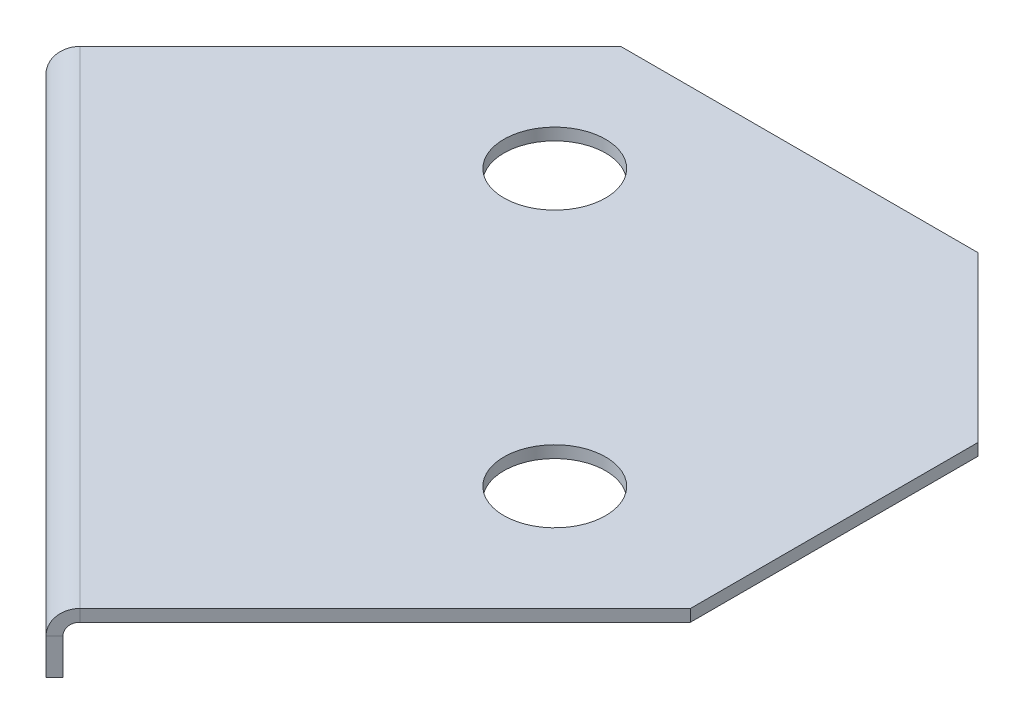
ISO-10303-21;
HEADER;
FILE_DESCRIPTION(('STEP AP214'),'2;1');
FILE_NAME('part.step','',(''),(''),'','','');
FILE_SCHEMA(('AUTOMOTIVE_DESIGN { 1 0 10303 214 1 1 1 1 }'));
ENDSEC;
DATA;
#1=APPLICATION_CONTEXT('core data for automotive mechanical design processes');
#2=APPLICATION_PROTOCOL_DEFINITION('international standard','automotive_design',2000,#1);
#3=PRODUCT_CONTEXT('',#1,'mechanical');
#4=PRODUCT('Part','Part','',(#3));
#5=PRODUCT_RELATED_PRODUCT_CATEGORY('part','',(#4));
#6=PRODUCT_DEFINITION_FORMATION('','',#4);
#7=PRODUCT_DEFINITION_CONTEXT('part definition',#1,'design');
#8=PRODUCT_DEFINITION('design','',#6,#7);
#9=PRODUCT_DEFINITION_SHAPE('','',#8);
#10=(LENGTH_UNIT() NAMED_UNIT(*) SI_UNIT(.MILLI.,.METRE.));
#11=(NAMED_UNIT(*) PLANE_ANGLE_UNIT() SI_UNIT($,.RADIAN.));
#12=(NAMED_UNIT(*) SI_UNIT($,.STERADIAN.) SOLID_ANGLE_UNIT());
#13=UNCERTAINTY_MEASURE_WITH_UNIT(LENGTH_MEASURE(1.E-05),#10,'distance_accuracy_value','');
#14=(GEOMETRIC_REPRESENTATION_CONTEXT(3) GLOBAL_UNCERTAINTY_ASSIGNED_CONTEXT((#13)) GLOBAL_UNIT_ASSIGNED_CONTEXT((#10,
#11,#12)) REPRESENTATION_CONTEXT('',''));
#15=CARTESIAN_POINT('',(0.,0.,0.));
#16=DIRECTION('',(0.,0.,1.));
#17=DIRECTION('',(1.,0.,0.));
#18=AXIS2_PLACEMENT_3D('',#15,#16,#17);
#19=CARTESIAN_POINT('',(-0.213435894847878,-0.2,-10.1379431588362));
#20=DIRECTION('',(-0.70710678118654,0.,-0.707106781186555));
#21=DIRECTION('',(-0.707106781186555,0.,0.70710678118654));
#22=AXIS2_PLACEMENT_3D('',#19,#20,#21);
#23=PLANE('',#22);
#24=DIRECTION('',(-0.707106781186555,0.,0.70710678118654));
#25=VECTOR('',#24,1.);
#26=CARTESIAN_POINT('',(-0.213435894847878,-0.2,-10.1379431588362));
#27=LINE('',#26,#25);
#28=CARTESIAN_POINT('',(-0.213435894847878,-0.2,-10.1379431588362));
#29=VERTEX_POINT('',#28);
#30=CARTESIAN_POINT('',(-4.73223163264668,-0.199999999999815,-5.61914742103748));
#31=VERTEX_POINT('',#30);
#32=EDGE_CURVE('E189',#29,#31,#27,.T.);
#33=ORIENTED_EDGE('',*,*,#32,.T.);
#34=DIRECTION('',(2.26595308008029E-13,1.,-2.1142236967598E-13));
#35=VECTOR('',#34,1.);
#36=CARTESIAN_POINT('',(-4.73223163264668,-0.199999999999815,-5.61914742103748));
#37=LINE('',#36,#35);
#38=CARTESIAN_POINT('',(-4.73223163264663,1.85181731060524E-13,-5.61914742103752));
#39=VERTEX_POINT('',#38);
#40=EDGE_CURVE('E173',#31,#39,#37,.T.);
#41=ORIENTED_EDGE('',*,*,#40,.T.);
#42=DIRECTION('',(-0.707106781186555,0.,0.70710678118654));
#43=VECTOR('',#42,1.);
#44=CARTESIAN_POINT('',(-0.213435894847878,0.,-10.1379431588362));
#45=LINE('',#44,#43);
#46=CARTESIAN_POINT('',(-0.213435894847878,0.,-10.1379431588362));
#47=VERTEX_POINT('',#46);
#48=EDGE_CURVE('E201',#47,#39,#45,.T.);
#49=ORIENTED_EDGE('',*,*,#48,.F.);
#50=DIRECTION('',(0.,1.,0.));
#51=VECTOR('',#50,1.);
#52=CARTESIAN_POINT('',(-0.213435894847878,-0.2,-10.1379431588362));
#53=LINE('',#52,#51);
#54=EDGE_CURVE('E209',#29,#47,#53,.T.);
#55=ORIENTED_EDGE('',*,*,#54,.F.);
#56=EDGE_LOOP('',(#33,#41,#49,#55));
#57=FACE_BOUND('',#56,.T.);
#58=ADVANCED_FACE('F38',(#57),#23,.T.);
#59=CARTESIAN_POINT('',(0.,-0.2,0.));
#60=DIRECTION('',(0.,1.,0.));
#61=DIRECTION('',(0.,0.,1.));
#62=AXIS2_PLACEMENT_3D('',#59,#60,#61);
#63=PLANE('',#62);
#64=CARTESIAN_POINT('',(1.00251185967367,-0.2,-7.81835700742499));
#65=DIRECTION('',(0.,1.,0.));
#66=DIRECTION('',(0.,0.,1.));
#67=AXIS2_PLACEMENT_3D('',#64,#65,#66);
#68=CIRCLE('',#67,0.849999999999994);
#69=CARTESIAN_POINT('',(1.00251185967367,-0.2,-6.968357007425));
#70=VERTEX_POINT('',#69);
#71=EDGE_CURVE('E304',#70,#70,#68,.T.);
#72=ORIENTED_EDGE('',*,*,#71,.T.);
#73=EDGE_LOOP('',(#72));
#74=FACE_BOUND('',#73,.T.);
#75=CARTESIAN_POINT('',(5.59870593738606,-0.2,-3.2221629297126));
#76=DIRECTION('',(0.,1.,0.));
#77=DIRECTION('',(0.,0.,1.));
#78=AXIS2_PLACEMENT_3D('',#75,#76,#77);
#79=CIRCLE('',#78,0.849999999999994);
#80=CARTESIAN_POINT('',(5.59870593738606,-0.2,-2.37216292971261));
#81=VERTEX_POINT('',#80);
#82=EDGE_CURVE('E314',#81,#81,#79,.T.);
#83=ORIENTED_EDGE('',*,*,#82,.T.);
#84=EDGE_LOOP('',(#83));
#85=FACE_BOUND('',#84,.T.);
#86=DIRECTION('',(-0.707106781186548,0.,-0.707106781186548));
#87=VECTOR('',#86,1.);
#88=CARTESIAN_POINT('',(-4.73223163264668,-0.199999999999815,-5.61914742103748));
#89=LINE('',#88,#87);
#90=CARTESIAN_POINT('',(3.39949635099849,-0.199999999999938,2.5125805626077));
#91=VERTEX_POINT('',#90);
#92=EDGE_CURVE('E177',#31,#91,#89,.F.);
#93=ORIENTED_EDGE('',*,*,#92,.F.);
#94=ORIENTED_EDGE('',*,*,#32,.F.);
#95=DIRECTION('',(-1.,0.,0.));
#96=VECTOR('',#95,1.);
#97=CARTESIAN_POINT('',(5.75399352012794,-0.2,-10.1379431588362));
#98=LINE('',#97,#96);
#99=CARTESIAN_POINT('',(5.75399352012794,-0.2,-10.1379431588362));
#100=VERTEX_POINT('',#99);
#101=EDGE_CURVE('E186',#100,#29,#98,.T.);
#102=ORIENTED_EDGE('',*,*,#101,.F.);
#103=DIRECTION('',(-0.707106781186549,0.,-0.707106781186546));
#104=VECTOR('',#103,1.);
#105=CARTESIAN_POINT('',(8.49999999999949,-0.2,-7.39193667896464));
#106=LINE('',#105,#104);
#107=CARTESIAN_POINT('',(8.49999999999949,-0.2,-7.39193667896464));
#108=VERTEX_POINT('',#107);
#109=EDGE_CURVE('E184',#108,#100,#106,.T.);
#110=ORIENTED_EDGE('',*,*,#109,.F.);
#111=DIRECTION('',(0.,0.,-1.));
#112=VECTOR('',#111,1.);
#113=CARTESIAN_POINT('',(8.49999999999949,-0.2,-2.5879230863932));
#114=LINE('',#113,#112);
#115=CARTESIAN_POINT('',(8.49999999999949,-0.2,-2.5879230863932));
#116=VERTEX_POINT('',#115);
#117=EDGE_CURVE('E194',#116,#108,#114,.T.);
#118=ORIENTED_EDGE('',*,*,#117,.F.);
#119=DIRECTION('',(0.707106781186555,0.,-0.70710678118654));
#120=VECTOR('',#119,1.);
#121=CARTESIAN_POINT('',(3.2580749947611,-0.2,2.65400191884509));
#122=LINE('',#121,#120);
#123=EDGE_CURVE('E192',#91,#116,#122,.T.);
#124=ORIENTED_EDGE('',*,*,#123,.F.);
#125=EDGE_LOOP('',(#93,#94,#102,#110,#118,#124));
#126=FACE_BOUND('',#125,.T.);
#127=ADVANCED_FACE('F222',(#74,#85,#126),#63,.F.);
#128=CARTESIAN_POINT('',(0.,0.,0.));
#129=DIRECTION('',(0.,1.,0.));
#130=DIRECTION('',(0.,0.,1.));
#131=AXIS2_PLACEMENT_3D('',#128,#129,#130);
#132=PLANE('',#131);
#133=CARTESIAN_POINT('',(1.00251185967367,0.,-7.81835700742499));
#134=DIRECTION('',(0.,1.,0.));
#135=DIRECTION('',(0.,0.,1.));
#136=AXIS2_PLACEMENT_3D('',#133,#134,#135);
#137=CIRCLE('',#136,0.849999999999988);
#138=CARTESIAN_POINT('',(1.00251185967367,0.,-6.968357007425));
#139=VERTEX_POINT('',#138);
#140=EDGE_CURVE('E307',#139,#139,#137,.T.);
#141=ORIENTED_EDGE('',*,*,#140,.F.);
#142=EDGE_LOOP('',(#141));
#143=FACE_BOUND('',#142,.T.);
#144=CARTESIAN_POINT('',(5.59870593738606,0.,-3.2221629297126));
#145=DIRECTION('',(0.,1.,0.));
#146=DIRECTION('',(0.,0.,1.));
#147=AXIS2_PLACEMENT_3D('',#144,#145,#146);
#148=CIRCLE('',#147,0.849999999999988);
#149=CARTESIAN_POINT('',(5.59870593738606,0.,-2.37216292971262));
#150=VERTEX_POINT('',#149);
#151=EDGE_CURVE('E309',#150,#150,#148,.T.);
#152=ORIENTED_EDGE('',*,*,#151,.F.);
#153=EDGE_LOOP('',(#152));
#154=FACE_BOUND('',#153,.T.);
#155=ORIENTED_EDGE('',*,*,#48,.T.);
#156=DIRECTION('',(-0.707106781186548,0.,-0.707106781186548));
#157=VECTOR('',#156,1.);
#158=CARTESIAN_POINT('',(-4.73223163264663,1.85181731060524E-13,-5.61914742103752));
#159=LINE('',#158,#157);
#160=CARTESIAN_POINT('',(3.39949635099849,0.,2.5125805626077));
#161=VERTEX_POINT('',#160);
#162=EDGE_CURVE('E127',#39,#161,#159,.F.);
#163=ORIENTED_EDGE('',*,*,#162,.T.);
#164=DIRECTION('',(0.707106781186555,0.,-0.70710678118654));
#165=VECTOR('',#164,1.);
#166=CARTESIAN_POINT('',(3.2580749947611,0.,2.65400191884509));
#167=LINE('',#166,#165);
#168=CARTESIAN_POINT('',(8.49999999999949,0.,-2.5879230863932));
#169=VERTEX_POINT('',#168);
#170=EDGE_CURVE('E204',#161,#169,#167,.T.);
#171=ORIENTED_EDGE('',*,*,#170,.T.);
#172=DIRECTION('',(0.,0.,-1.));
#173=VECTOR('',#172,1.);
#174=CARTESIAN_POINT('',(8.49999999999949,0.,-2.5879230863932));
#175=LINE('',#174,#173);
#176=CARTESIAN_POINT('',(8.49999999999949,0.,-7.39193667896464));
#177=VERTEX_POINT('',#176);
#178=EDGE_CURVE('E187',#169,#177,#175,.T.);
#179=ORIENTED_EDGE('',*,*,#178,.T.);
#180=DIRECTION('',(-0.707106781186549,0.,-0.707106781186546));
#181=VECTOR('',#180,1.);
#182=CARTESIAN_POINT('',(8.49999999999949,0.,-7.39193667896464));
#183=LINE('',#182,#181);
#184=CARTESIAN_POINT('',(5.75399352012794,0.,-10.1379431588362));
#185=VERTEX_POINT('',#184);
#186=EDGE_CURVE('E182',#177,#185,#183,.T.);
#187=ORIENTED_EDGE('',*,*,#186,.T.);
#188=DIRECTION('',(-1.,0.,0.));
#189=VECTOR('',#188,1.);
#190=CARTESIAN_POINT('',(5.75399352012794,0.,-10.1379431588362));
#191=LINE('',#190,#189);
#192=EDGE_CURVE('E198',#185,#47,#191,.T.);
#193=ORIENTED_EDGE('',*,*,#192,.T.);
#194=EDGE_LOOP('',(#155,#163,#171,#179,#187,#193));
#195=FACE_BOUND('',#194,.T.);
#196=ADVANCED_FACE('F213',(#143,#154,#195),#132,.T.);
#197=CARTESIAN_POINT('',(8.49999999999949,-0.2,-7.39193667896464));
#198=DIRECTION('',(0.707106781186546,0.,-0.707106781186549));
#199=DIRECTION('',(-0.707106781186549,0.,-0.707106781186546));
#200=AXIS2_PLACEMENT_3D('',#197,#198,#199);
#201=PLANE('',#200);
#202=ORIENTED_EDGE('',*,*,#186,.F.);
#203=DIRECTION('',(0.,1.,0.));
#204=VECTOR('',#203,1.);
#205=CARTESIAN_POINT('',(8.49999999999949,-0.2,-7.39193667896464));
#206=LINE('',#205,#204);
#207=EDGE_CURVE('E11',#108,#177,#206,.T.);
#208=ORIENTED_EDGE('',*,*,#207,.F.);
#209=ORIENTED_EDGE('',*,*,#109,.T.);
#210=DIRECTION('',(0.,1.,0.));
#211=VECTOR('',#210,1.);
#212=CARTESIAN_POINT('',(5.75399352012794,-0.2,-10.1379431588362));
#213=LINE('',#212,#211);
#214=EDGE_CURVE('E42',#100,#185,#213,.T.);
#215=ORIENTED_EDGE('',*,*,#214,.T.);
#216=EDGE_LOOP('',(#202,#208,#209,#215));
#217=FACE_BOUND('',#216,.T.);
#218=ADVANCED_FACE('F40',(#217),#201,.T.);
#219=CARTESIAN_POINT('',(8.49999999999949,-0.2,-2.5879230863932));
#220=DIRECTION('',(1.,0.,0.));
#221=DIRECTION('',(0.,0.,-1.));
#222=AXIS2_PLACEMENT_3D('',#219,#220,#221);
#223=PLANE('',#222);
#224=ORIENTED_EDGE('',*,*,#178,.F.);
#225=DIRECTION('',(0.,1.,0.));
#226=VECTOR('',#225,1.);
#227=CARTESIAN_POINT('',(8.49999999999949,-0.2,-2.5879230863932));
#228=LINE('',#227,#226);
#229=EDGE_CURVE('E47',#116,#169,#228,.T.);
#230=ORIENTED_EDGE('',*,*,#229,.F.);
#231=ORIENTED_EDGE('',*,*,#117,.T.);
#232=ORIENTED_EDGE('',*,*,#207,.T.);
#233=EDGE_LOOP('',(#224,#230,#231,#232));
#234=FACE_BOUND('',#233,.T.);
#235=ADVANCED_FACE('F216',(#234),#223,.T.);
#236=CARTESIAN_POINT('',(3.2580749947611,-0.2,2.65400191884509));
#237=DIRECTION('',(0.70710678118654,0.,0.707106781186555));
#238=DIRECTION('',(0.707106781186555,0.,-0.70710678118654));
#239=AXIS2_PLACEMENT_3D('',#236,#237,#238);
#240=PLANE('',#239);
#241=DIRECTION('',(2.16840434497034E-13,1.,-2.16840434497034E-13));
#242=VECTOR('',#241,1.);
#243=CARTESIAN_POINT('',(3.39949635099849,-0.199999999999938,2.5125805626077));
#244=LINE('',#243,#242);
#245=EDGE_CURVE('E180',#91,#161,#244,.T.);
#246=ORIENTED_EDGE('',*,*,#245,.F.);
#247=ORIENTED_EDGE('',*,*,#123,.T.);
#248=ORIENTED_EDGE('',*,*,#229,.T.);
#249=ORIENTED_EDGE('',*,*,#170,.F.);
#250=EDGE_LOOP('',(#246,#247,#248,#249));
#251=FACE_BOUND('',#250,.T.);
#252=ADVANCED_FACE('F226',(#251),#240,.T.);
#253=CARTESIAN_POINT('',(5.75399352012794,-0.2,-10.1379431588362));
#254=DIRECTION('',(0.,0.,-1.));
#255=DIRECTION('',(-1.,0.,0.));
#256=AXIS2_PLACEMENT_3D('',#253,#254,#255);
#257=PLANE('',#256);
#258=ORIENTED_EDGE('',*,*,#192,.F.);
#259=ORIENTED_EDGE('',*,*,#214,.F.);
#260=ORIENTED_EDGE('',*,*,#101,.T.);
#261=ORIENTED_EDGE('',*,*,#54,.T.);
#262=EDGE_LOOP('',(#258,#259,#260,#261));
#263=FACE_BOUND('',#262,.T.);
#264=ADVANCED_FACE('F211',(#263),#257,.T.);
#265=CARTESIAN_POINT('',(3.39949635099845,-0.4,2.51258056260774));
#266=DIRECTION('',(0.707106781186548,0.,0.707106781186548));
#267=DIRECTION('',(0.707106781186548,0.,-0.707106781186548));
#268=AXIS2_PLACEMENT_3D('',#265,#266,#267);
#269=PLANE('',#268);
#270=DIRECTION('',(-0.707106781186555,0.,0.70710678118654));
#271=VECTOR('',#270,1.);
#272=CARTESIAN_POINT('',(3.2580749947611,-0.399999999999999,2.65400191884509));
#273=LINE('',#272,#271);
#274=CARTESIAN_POINT('',(3.2580749947611,-0.399999999999999,2.65400191884509));
#275=VERTEX_POINT('',#274);
#276=CARTESIAN_POINT('',(3.11665363852379,-0.399999999999998,2.7954232750824));
#277=VERTEX_POINT('',#276);
#278=EDGE_CURVE('E231',#275,#277,#273,.T.);
#279=ORIENTED_EDGE('',*,*,#278,.F.);
#280=CARTESIAN_POINT('',(3.39949635099845,-0.4,2.51258056260774));
#281=DIRECTION('',(-0.707106781186548,0.,-0.707106781186548));
#282=DIRECTION('',(-0.707106781186548,0.,0.707106781186548));
#283=AXIS2_PLACEMENT_3D('',#280,#281,#282);
#284=CIRCLE('',#283,0.200000000000062);
#285=EDGE_CURVE('E130',#91,#275,#284,.F.);
#286=ORIENTED_EDGE('',*,*,#285,.F.);
#287=ORIENTED_EDGE('',*,*,#245,.T.);
#288=CARTESIAN_POINT('',(3.39949635099845,-0.4,2.51258056260774));
#289=DIRECTION('',(-0.707106781186548,0.,-0.707106781186548));
#290=DIRECTION('',(-0.707106781186548,0.,0.707106781186548));
#291=AXIS2_PLACEMENT_3D('',#288,#289,#290);
#292=CIRCLE('',#291,0.400000000000062);
#293=EDGE_CURVE('E55',#161,#277,#292,.F.);
#294=ORIENTED_EDGE('',*,*,#293,.T.);
#295=EDGE_LOOP('',(#279,#286,#287,#294));
#296=FACE_BOUND('',#295,.T.);
#297=ADVANCED_FACE('F229',(#296),#269,.T.);
#298=CARTESIAN_POINT('',(-4.73223163264672,-0.399999999999877,-5.61914742103744));
#299=DIRECTION('',(0.707106781186548,0.,0.707106781186548));
#300=DIRECTION('',(0.707106781186548,0.,-0.707106781186548));
#301=AXIS2_PLACEMENT_3D('',#298,#299,#300);
#302=PLANE('',#301);
#303=CARTESIAN_POINT('',(-4.73223163264672,-0.399999999999877,-5.61914742103744));
#304=DIRECTION('',(-0.707106781186548,0.,-0.707106781186548));
#305=DIRECTION('',(-0.707106781186548,0.,0.707106781186548));
#306=AXIS2_PLACEMENT_3D('',#303,#304,#305);
#307=CIRCLE('',#306,0.200000000000062);
#308=CARTESIAN_POINT('',(-4.87365298888408,-0.399999999999876,-5.47772606480008));
#309=VERTEX_POINT('',#308);
#310=EDGE_CURVE('E137',#309,#31,#307,.T.);
#311=ORIENTED_EDGE('',*,*,#310,.F.);
#312=DIRECTION('',(-0.707106781186555,0.,0.70710678118654));
#313=VECTOR('',#312,1.);
#314=CARTESIAN_POINT('',(-4.87365298888399,-0.399999999999876,-5.47772606480017));
#315=LINE('',#314,#313);
#316=CARTESIAN_POINT('',(-5.0150743451213,-0.399999999999875,-5.33630470856286));
#317=VERTEX_POINT('',#316);
#318=EDGE_CURVE('E134',#309,#317,#315,.T.);
#319=ORIENTED_EDGE('',*,*,#318,.T.);
#320=CARTESIAN_POINT('',(-4.73223163264672,-0.399999999999877,-5.61914742103744));
#321=DIRECTION('',(-0.707106781186548,0.,-0.707106781186548));
#322=DIRECTION('',(-0.707106781186548,0.,0.707106781186548));
#323=AXIS2_PLACEMENT_3D('',#320,#321,#322);
#324=CIRCLE('',#323,0.400000000000062);
#325=EDGE_CURVE('E121',#317,#39,#324,.T.);
#326=ORIENTED_EDGE('',*,*,#325,.T.);
#327=ORIENTED_EDGE('',*,*,#40,.F.);
#328=EDGE_LOOP('',(#311,#319,#326,#327));
#329=FACE_BOUND('',#328,.T.);
#330=ADVANCED_FACE('F135',(#329),#302,.F.);
#331=CARTESIAN_POINT('',(-4.73223163264672,-0.399999999999877,-5.61914742103744));
#332=DIRECTION('',(-0.707106781186548,0.,-0.707106781186548));
#333=DIRECTION('',(-0.707106781186548,0.,0.707106781186548));
#334=AXIS2_PLACEMENT_3D('',#331,#332,#333);
#335=CYLINDRICAL_SURFACE('',#334,0.400000000000062);
#336=ORIENTED_EDGE('',*,*,#162,.F.);
#337=ORIENTED_EDGE('',*,*,#325,.F.);
#338=DIRECTION('',(0.70710678118654,0.,0.707106781186555));
#339=VECTOR('',#338,1.);
#340=CARTESIAN_POINT('',(0.160615181720724,-0.399999999999954,-0.160615181720726));
#341=LINE('',#340,#339);
#342=EDGE_CURVE('E125',#317,#277,#341,.T.);
#343=ORIENTED_EDGE('',*,*,#342,.T.);
#344=ORIENTED_EDGE('',*,*,#293,.F.);
#345=EDGE_LOOP('',(#336,#337,#343,#344));
#346=FACE_BOUND('',#345,.T.);
#347=ADVANCED_FACE('F123',(#346),#335,.T.);
#348=CARTESIAN_POINT('',(-4.73223163264672,-0.399999999999877,-5.61914742103744));
#349=DIRECTION('',(-0.707106781186548,0.,-0.707106781186548));
#350=DIRECTION('',(-0.707106781186548,0.,0.707106781186548));
#351=AXIS2_PLACEMENT_3D('',#348,#349,#350);
#352=CYLINDRICAL_SURFACE('',#351,0.200000000000062);
#353=ORIENTED_EDGE('',*,*,#92,.T.);
#354=ORIENTED_EDGE('',*,*,#285,.T.);
#355=DIRECTION('',(-0.70710678118654,0.,-0.707106781186555));
#356=VECTOR('',#355,1.);
#357=CARTESIAN_POINT('',(3.2580749947611,-0.399999999999999,2.65400191884509));
#358=LINE('',#357,#356);
#359=EDGE_CURVE('E141',#275,#309,#358,.T.);
#360=ORIENTED_EDGE('',*,*,#359,.T.);
#361=ORIENTED_EDGE('',*,*,#310,.T.);
#362=EDGE_LOOP('',(#353,#354,#360,#361));
#363=FACE_BOUND('',#362,.T.);
#364=ADVANCED_FACE('F234',(#363),#352,.F.);
#365=CARTESIAN_POINT('',(-5.0150743451213,-1.,-5.33630470856286));
#366=DIRECTION('',(0.70710678118654,0.,0.707106781186555));
#367=DIRECTION('',(0.707106781186555,0.,-0.70710678118654));
#368=AXIS2_PLACEMENT_3D('',#365,#366,#367);
#369=PLANE('',#368);
#370=ORIENTED_EDGE('',*,*,#318,.F.);
#371=DIRECTION('',(0.,-1.,0.));
#372=VECTOR('',#371,1.);
#373=CARTESIAN_POINT('',(-4.87365298888399,-1.,-5.47772606480017));
#374=LINE('',#373,#372);
#375=CARTESIAN_POINT('',(-4.87365298888399,-1.,-5.47772606480017));
#376=VERTEX_POINT('',#375);
#377=EDGE_CURVE('E150',#309,#376,#374,.T.);
#378=ORIENTED_EDGE('',*,*,#377,.T.);
#379=DIRECTION('',(0.707106781186555,0.,-0.70710678118654));
#380=VECTOR('',#379,1.);
#381=CARTESIAN_POINT('',(-5.0150743451213,-1.,-5.33630470856286));
#382=LINE('',#381,#380);
#383=CARTESIAN_POINT('',(-5.0150743451213,-1.,-5.33630470856286));
#384=VERTEX_POINT('',#383);
#385=EDGE_CURVE('E154',#384,#376,#382,.T.);
#386=ORIENTED_EDGE('',*,*,#385,.F.);
#387=DIRECTION('',(0.,-1.,0.));
#388=VECTOR('',#387,1.);
#389=CARTESIAN_POINT('',(-5.0150743451213,-1.,-5.33630470856286));
#390=LINE('',#389,#388);
#391=EDGE_CURVE('E146',#317,#384,#390,.T.);
#392=ORIENTED_EDGE('',*,*,#391,.F.);
#393=EDGE_LOOP('',(#370,#378,#386,#392));
#394=FACE_BOUND('',#393,.T.);
#395=ADVANCED_FACE('F152',(#394),#369,.F.);
#396=CARTESIAN_POINT('',(3.11665363852379,-0.199999999999999,2.7954232750824));
#397=DIRECTION('',(-0.70710678118654,0.,-0.707106781186555));
#398=DIRECTION('',(-0.707106781186555,0.,0.70710678118654));
#399=AXIS2_PLACEMENT_3D('',#396,#397,#398);
#400=PLANE('',#399);
#401=ORIENTED_EDGE('',*,*,#278,.T.);
#402=DIRECTION('',(0.,1.,0.));
#403=VECTOR('',#402,1.);
#404=CARTESIAN_POINT('',(3.11665363852379,-0.199999999999999,2.7954232750824));
#405=LINE('',#404,#403);
#406=CARTESIAN_POINT('',(3.11665363852378,-1.,2.7954232750824));
#407=VERTEX_POINT('',#406);
#408=EDGE_CURVE('E149',#407,#277,#405,.T.);
#409=ORIENTED_EDGE('',*,*,#408,.F.);
#410=DIRECTION('',(0.707106781186555,0.,-0.70710678118654));
#411=VECTOR('',#410,1.);
#412=CARTESIAN_POINT('',(3.11665363852378,-1.,2.7954232750824));
#413=LINE('',#412,#411);
#414=CARTESIAN_POINT('',(3.25807499476109,-1.,2.65400191884509));
#415=VERTEX_POINT('',#414);
#416=EDGE_CURVE('E166',#407,#415,#413,.T.);
#417=ORIENTED_EDGE('',*,*,#416,.T.);
#418=DIRECTION('',(0.,1.,0.));
#419=VECTOR('',#418,1.);
#420=CARTESIAN_POINT('',(3.2580749947611,-0.2,2.65400191884509));
#421=LINE('',#420,#419);
#422=EDGE_CURVE('E157',#415,#275,#421,.T.);
#423=ORIENTED_EDGE('',*,*,#422,.T.);
#424=EDGE_LOOP('',(#401,#409,#417,#423));
#425=FACE_BOUND('',#424,.T.);
#426=ADVANCED_FACE('F241',(#425),#400,.F.);
#427=CARTESIAN_POINT('',(0.160615181720728,0.,-0.160615181720724));
#428=DIRECTION('',(0.707106781186555,0.,-0.70710678118654));
#429=DIRECTION('',(-0.70710678118654,0.,-0.707106781186555));
#430=AXIS2_PLACEMENT_3D('',#427,#428,#429);
#431=PLANE('',#430);
#432=ORIENTED_EDGE('',*,*,#342,.F.);
#433=ORIENTED_EDGE('',*,*,#391,.T.);
#434=DIRECTION('',(0.70710678118654,0.,0.707106781186555));
#435=VECTOR('',#434,1.);
#436=CARTESIAN_POINT('',(3.11665363852378,-1.,2.7954232750824));
#437=LINE('',#436,#435);
#438=EDGE_CURVE('E156',#384,#407,#437,.T.);
#439=ORIENTED_EDGE('',*,*,#438,.T.);
#440=ORIENTED_EDGE('',*,*,#408,.T.);
#441=EDGE_LOOP('',(#432,#433,#439,#440));
#442=FACE_BOUND('',#441,.T.);
#443=ADVANCED_FACE('F145',(#442),#431,.F.);
#444=CARTESIAN_POINT('',(0.302036537958039,0.,-0.302036537958032));
#445=DIRECTION('',(0.707106781186555,0.,-0.70710678118654));
#446=DIRECTION('',(-0.70710678118654,0.,-0.707106781186555));
#447=AXIS2_PLACEMENT_3D('',#444,#445,#446);
#448=PLANE('',#447);
#449=ORIENTED_EDGE('',*,*,#377,.F.);
#450=ORIENTED_EDGE('',*,*,#359,.F.);
#451=ORIENTED_EDGE('',*,*,#422,.F.);
#452=DIRECTION('',(0.70710678118654,0.,0.707106781186555));
#453=VECTOR('',#452,1.);
#454=CARTESIAN_POINT('',(3.25807499476109,-1.,2.65400191884509));
#455=LINE('',#454,#453);
#456=EDGE_CURVE('E161',#376,#415,#455,.T.);
#457=ORIENTED_EDGE('',*,*,#456,.F.);
#458=EDGE_LOOP('',(#449,#450,#451,#457));
#459=FACE_BOUND('',#458,.T.);
#460=ADVANCED_FACE('F237',(#459),#448,.T.);
#461=CARTESIAN_POINT('',(3.11665363852378,-1.,2.7954232750824));
#462=DIRECTION('',(0.,1.,0.));
#463=DIRECTION('',(-1.,0.,0.));
#464=AXIS2_PLACEMENT_3D('',#461,#462,#463);
#465=PLANE('',#464);
#466=ORIENTED_EDGE('',*,*,#456,.T.);
#467=ORIENTED_EDGE('',*,*,#416,.F.);
#468=ORIENTED_EDGE('',*,*,#438,.F.);
#469=ORIENTED_EDGE('',*,*,#385,.T.);
#470=EDGE_LOOP('',(#466,#467,#468,#469));
#471=FACE_BOUND('',#470,.T.);
#472=ADVANCED_FACE('F244',(#471),#465,.F.);
#473=CARTESIAN_POINT('',(5.59870593738606,0.,-3.2221629297126));
#474=DIRECTION('',(0.,1.,0.));
#475=DIRECTION('',(0.,0.,1.));
#476=AXIS2_PLACEMENT_3D('',#473,#474,#475);
#477=CYLINDRICAL_SURFACE('',#476,0.849999999999994);
#478=ORIENTED_EDGE('',*,*,#82,.F.);
#479=EDGE_LOOP('',(#478));
#480=FACE_BOUND('',#479,.T.);
#481=ORIENTED_EDGE('',*,*,#151,.T.);
#482=EDGE_LOOP('',(#481));
#483=FACE_BOUND('',#482,.T.);
#484=ADVANCED_FACE('F246',(#480,#483),#477,.F.);
#485=CARTESIAN_POINT('',(1.00251185967367,0.,-7.81835700742499));
#486=DIRECTION('',(0.,1.,0.));
#487=DIRECTION('',(0.,0.,1.));
#488=AXIS2_PLACEMENT_3D('',#485,#486,#487);
#489=CYLINDRICAL_SURFACE('',#488,0.849999999999994);
#490=ORIENTED_EDGE('',*,*,#71,.F.);
#491=EDGE_LOOP('',(#490));
#492=FACE_BOUND('',#491,.T.);
#493=ORIENTED_EDGE('',*,*,#140,.T.);
#494=EDGE_LOOP('',(#493));
#495=FACE_BOUND('',#494,.T.);
#496=ADVANCED_FACE('F252',(#492,#495),#489,.F.);
#497=CLOSED_SHELL('',(#58,#127,#196,#218,#235,#252,#264,#297,#330,#347,#364,#395,#426,#443,#460,
#472,#484,#496));
#498=MANIFOLD_SOLID_BREP('B2',#497);
#499=ADVANCED_BREP_SHAPE_REPRESENTATION('',(#18,#498),#14);
#500=SHAPE_DEFINITION_REPRESENTATION(#9,#499);
ENDSEC;
END-ISO-10303-21;
